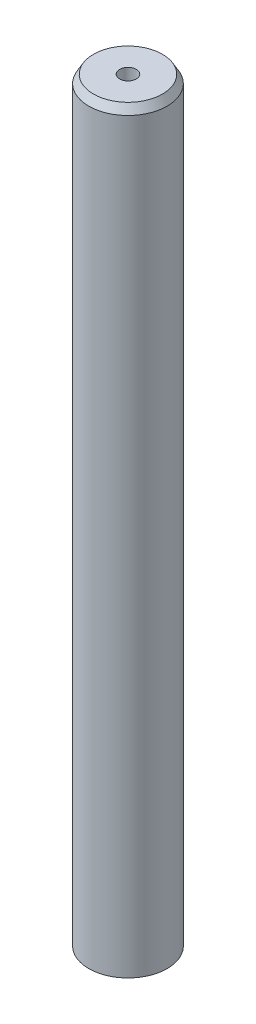
ISO-10303-21;
HEADER;
FILE_DESCRIPTION(('STEP AP214'),'2;1');
FILE_NAME('part.step','',(''),(''),'','','');
FILE_SCHEMA(('AUTOMOTIVE_DESIGN { 1 0 10303 214 1 1 1 1 }'));
ENDSEC;
DATA;
#1=APPLICATION_CONTEXT('core data for automotive mechanical design processes');
#2=APPLICATION_PROTOCOL_DEFINITION('international standard','automotive_design',2000,#1);
#3=PRODUCT_CONTEXT('',#1,'mechanical');
#4=PRODUCT('Part','Part','',(#3));
#5=PRODUCT_RELATED_PRODUCT_CATEGORY('part','',(#4));
#6=PRODUCT_DEFINITION_FORMATION('','',#4);
#7=PRODUCT_DEFINITION_CONTEXT('part definition',#1,'design');
#8=PRODUCT_DEFINITION('design','',#6,#7);
#9=PRODUCT_DEFINITION_SHAPE('','',#8);
#10=(LENGTH_UNIT() NAMED_UNIT(*) SI_UNIT(.MILLI.,.METRE.));
#11=(NAMED_UNIT(*) PLANE_ANGLE_UNIT() SI_UNIT($,.RADIAN.));
#12=(NAMED_UNIT(*) SI_UNIT($,.STERADIAN.) SOLID_ANGLE_UNIT());
#13=UNCERTAINTY_MEASURE_WITH_UNIT(LENGTH_MEASURE(1.E-05),#10,'distance_accuracy_value','');
#14=(GEOMETRIC_REPRESENTATION_CONTEXT(3) GLOBAL_UNCERTAINTY_ASSIGNED_CONTEXT((#13)) GLOBAL_UNIT_ASSIGNED_CONTEXT((#10,
#11,#12)) REPRESENTATION_CONTEXT('',''));
#15=CARTESIAN_POINT('',(0.,0.,0.));
#16=DIRECTION('',(0.,0.,1.));
#17=DIRECTION('',(1.,0.,0.));
#18=AXIS2_PLACEMENT_3D('',#15,#16,#17);
#19=CARTESIAN_POINT('',(0.,96.9528881754269,0.));
#20=DIRECTION('',(0.,-1.,0.));
#21=DIRECTION('',(0.,0.,-1.));
#22=AXIS2_PLACEMENT_3D('',#19,#20,#21);
#23=CYLINDRICAL_SURFACE('',#22,5.);
#24=CARTESIAN_POINT('',(0.,95.9169295615208,0.));
#25=DIRECTION('',(0.,1.,0.));
#26=DIRECTION('',(0.,0.,1.));
#27=AXIS2_PLACEMENT_3D('',#24,#25,#26);
#28=CIRCLE('',#27,5.);
#29=CARTESIAN_POINT('',(0.,95.9169295615208,5.));
#30=VERTEX_POINT('',#29);
#31=EDGE_CURVE('E50',#30,#30,#28,.F.);
#32=ORIENTED_EDGE('',*,*,#31,.T.);
#33=EDGE_LOOP('',(#32));
#34=FACE_BOUND('',#33,.T.);
#35=CARTESIAN_POINT('',(0.,0.598110984608047,0.));
#36=DIRECTION('',(0.,1.,0.));
#37=DIRECTION('',(0.,0.,1.));
#38=AXIS2_PLACEMENT_3D('',#35,#36,#37);
#39=CIRCLE('',#38,5.);
#40=CARTESIAN_POINT('',(0.,0.598110984608047,5.));
#41=VERTEX_POINT('',#40);
#42=EDGE_CURVE('E51',#41,#41,#39,.T.);
#43=ORIENTED_EDGE('',*,*,#42,.T.);
#44=EDGE_LOOP('',(#43));
#45=FACE_BOUND('',#44,.T.);
#46=ADVANCED_FACE('F39',(#34,#45),#23,.T.);
#47=CARTESIAN_POINT('',(0.,96.9528881754269,0.));
#48=DIRECTION('',(0.,1.,0.));
#49=DIRECTION('',(0.,0.,1.));
#50=AXIS2_PLACEMENT_3D('',#47,#48,#49);
#51=PLANE('',#50);
#52=CARTESIAN_POINT('',(0.,96.9528881754269,0.));
#53=DIRECTION('',(0.,1.,0.));
#54=DIRECTION('',(0.,0.,1.));
#55=AXIS2_PLACEMENT_3D('',#52,#53,#54);
#56=CIRCLE('',#55,4.40188901539197);
#57=CARTESIAN_POINT('',(0.,96.9528881754269,4.40188901539197));
#58=VERTEX_POINT('',#57);
#59=EDGE_CURVE('E54',#58,#58,#56,.T.);
#60=ORIENTED_EDGE('',*,*,#59,.T.);
#61=EDGE_LOOP('',(#60));
#62=FACE_BOUND('',#61,.T.);
#63=CARTESIAN_POINT('',(0.,96.9528881754269,0.));
#64=DIRECTION('',(0.,1.,0.));
#65=DIRECTION('',(0.,0.,1.));
#66=AXIS2_PLACEMENT_3D('',#63,#64,#65);
#67=CIRCLE('',#66,1.06438839593577);
#68=CARTESIAN_POINT('',(0.,96.9528881754269,1.06438839593577));
#69=VERTEX_POINT('',#68);
#70=EDGE_CURVE('E58',#69,#69,#67,.T.);
#71=ORIENTED_EDGE('',*,*,#70,.F.);
#72=EDGE_LOOP('',(#71));
#73=FACE_BOUND('',#72,.T.);
#74=ADVANCED_FACE('F69',(#62,#73),#51,.T.);
#75=CARTESIAN_POINT('',(0.,0.,0.));
#76=DIRECTION('',(0.,1.,0.));
#77=DIRECTION('',(0.,0.,1.));
#78=AXIS2_PLACEMENT_3D('',#75,#76,#77);
#79=PLANE('',#78);
#80=CARTESIAN_POINT('',(0.,0.,0.));
#81=DIRECTION('',(0.,1.,0.));
#82=DIRECTION('',(0.,0.,1.));
#83=AXIS2_PLACEMENT_3D('',#80,#81,#82);
#84=CIRCLE('',#83,3.96404138609381);
#85=CARTESIAN_POINT('',(0.,0.,3.96404138609381));
#86=VERTEX_POINT('',#85);
#87=EDGE_CURVE('E10',#86,#86,#84,.F.);
#88=ORIENTED_EDGE('',*,*,#87,.T.);
#89=EDGE_LOOP('',(#88));
#90=FACE_BOUND('',#89,.T.);
#91=CARTESIAN_POINT('',(0.,0.,0.));
#92=DIRECTION('',(0.,1.,0.));
#93=DIRECTION('',(0.,0.,1.));
#94=AXIS2_PLACEMENT_3D('',#91,#92,#93);
#95=CIRCLE('',#94,1.06438839593577);
#96=CARTESIAN_POINT('',(0.,0.,1.06438839593577));
#97=VERTEX_POINT('',#96);
#98=EDGE_CURVE('E63',#97,#97,#95,.T.);
#99=ORIENTED_EDGE('',*,*,#98,.T.);
#100=EDGE_LOOP('',(#99));
#101=FACE_BOUND('',#100,.T.);
#102=ADVANCED_FACE('F75',(#90,#101),#79,.F.);
#103=CARTESIAN_POINT('',(0.,96.9528881754269,0.));
#104=DIRECTION('',(0.,-1.,0.));
#105=DIRECTION('',(0.,0.,-1.));
#106=AXIS2_PLACEMENT_3D('',#103,#104,#105);
#107=CYLINDRICAL_SURFACE('',#106,1.06438839593577);
#108=ORIENTED_EDGE('',*,*,#70,.T.);
#109=EDGE_LOOP('',(#108));
#110=FACE_BOUND('',#109,.T.);
#111=ORIENTED_EDGE('',*,*,#98,.F.);
#112=EDGE_LOOP('',(#111));
#113=FACE_BOUND('',#112,.T.);
#114=ADVANCED_FACE('F70',(#110,#113),#107,.F.);
#115=CARTESIAN_POINT('',(0.,96.9528881754269,0.));
#116=DIRECTION('',(0.,-1.,0.));
#117=DIRECTION('',(0.,0.,-1.));
#118=AXIS2_PLACEMENT_3D('',#115,#116,#117);
#119=CONICAL_SURFACE('',#118,4.40188901539197,0.523598775598293);
#120=ORIENTED_EDGE('',*,*,#31,.F.);
#121=EDGE_LOOP('',(#120));
#122=FACE_BOUND('',#121,.T.);
#123=ORIENTED_EDGE('',*,*,#59,.F.);
#124=EDGE_LOOP('',(#123));
#125=FACE_BOUND('',#124,.T.);
#126=ADVANCED_FACE('F81',(#122,#125),#119,.T.);
#127=CARTESIAN_POINT('',(0.,0.598110984608047,0.));
#128=DIRECTION('',(0.,1.,0.));
#129=DIRECTION('',(0.,0.,1.));
#130=AXIS2_PLACEMENT_3D('',#127,#128,#129);
#131=CONICAL_SURFACE('',#130,5.,1.0471975511966);
#132=ORIENTED_EDGE('',*,*,#87,.F.);
#133=EDGE_LOOP('',(#132));
#134=FACE_BOUND('',#133,.T.);
#135=ORIENTED_EDGE('',*,*,#42,.F.);
#136=EDGE_LOOP('',(#135));
#137=FACE_BOUND('',#136,.T.);
#138=ADVANCED_FACE('F45',(#134,#137),#131,.T.);
#139=CLOSED_SHELL('',(#46,#74,#102,#114,#126,#138));
#140=MANIFOLD_SOLID_BREP('B2',#139);
#141=ADVANCED_BREP_SHAPE_REPRESENTATION('',(#18,#140),#14);
#142=SHAPE_DEFINITION_REPRESENTATION(#9,#141);
ENDSEC;
END-ISO-10303-21;
